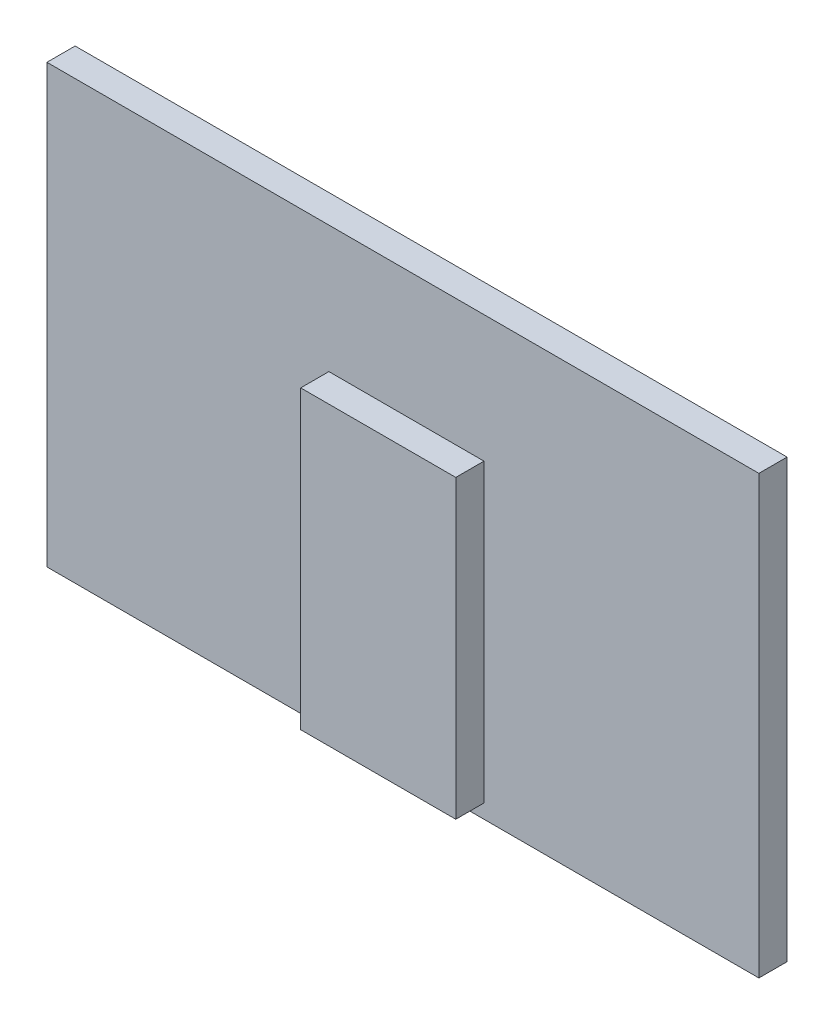
ISO-10303-21;
HEADER;
FILE_DESCRIPTION(('STEP AP214'),'2;1');
FILE_NAME('part.step','',(''),(''),'','','');
FILE_SCHEMA(('AUTOMOTIVE_DESIGN { 1 0 10303 214 1 1 1 1 }'));
ENDSEC;
DATA;
#1=APPLICATION_CONTEXT('core data for automotive mechanical design processes');
#2=APPLICATION_PROTOCOL_DEFINITION('international standard','automotive_design',2000,#1);
#3=PRODUCT_CONTEXT('',#1,'mechanical');
#4=PRODUCT('Part','Part','',(#3));
#5=PRODUCT_RELATED_PRODUCT_CATEGORY('part','',(#4));
#6=PRODUCT_DEFINITION_FORMATION('','',#4);
#7=PRODUCT_DEFINITION_CONTEXT('part definition',#1,'design');
#8=PRODUCT_DEFINITION('design','',#6,#7);
#9=PRODUCT_DEFINITION_SHAPE('','',#8);
#10=(LENGTH_UNIT() NAMED_UNIT(*) SI_UNIT(.MILLI.,.METRE.));
#11=(NAMED_UNIT(*) PLANE_ANGLE_UNIT() SI_UNIT($,.RADIAN.));
#12=(NAMED_UNIT(*) SI_UNIT($,.STERADIAN.) SOLID_ANGLE_UNIT());
#13=UNCERTAINTY_MEASURE_WITH_UNIT(LENGTH_MEASURE(1.E-05),#10,'distance_accuracy_value','');
#14=(GEOMETRIC_REPRESENTATION_CONTEXT(3) GLOBAL_UNCERTAINTY_ASSIGNED_CONTEXT((#13)) GLOBAL_UNIT_ASSIGNED_CONTEXT((#10,
#11,#12)) REPRESENTATION_CONTEXT('',''));
#15=CARTESIAN_POINT('',(0.,0.,0.));
#16=DIRECTION('',(0.,0.,1.));
#17=DIRECTION('',(1.,0.,0.));
#18=AXIS2_PLACEMENT_3D('',#15,#16,#17);
#19=CARTESIAN_POINT('',(0.,0.,20.));
#20=DIRECTION('',(0.,0.,1.));
#21=DIRECTION('',(1.,0.,0.));
#22=AXIS2_PLACEMENT_3D('',#19,#20,#21);
#23=PLANE('',#22);
#24=DIRECTION('',(0.,-1.,0.));
#25=VECTOR('',#24,1.);
#26=CARTESIAN_POINT('',(-332.927502245285,178.25,20.));
#27=LINE('',#26,#25);
#28=CARTESIAN_POINT('',(-332.927502245285,178.25,20.));
#29=VERTEX_POINT('',#28);
#30=CARTESIAN_POINT('',(-332.927502245285,-131.75,20.));
#31=VERTEX_POINT('',#30);
#32=EDGE_CURVE('E140',#29,#31,#27,.T.);
#33=ORIENTED_EDGE('',*,*,#32,.T.);
#34=DIRECTION('',(1.,0.,0.));
#35=VECTOR('',#34,1.);
#36=CARTESIAN_POINT('',(-332.927502245285,-131.75,20.));
#37=LINE('',#36,#35);
#38=CARTESIAN_POINT('',(172.072497754715,-131.75,20.));
#39=VERTEX_POINT('',#38);
#40=EDGE_CURVE('E85',#31,#39,#37,.T.);
#41=ORIENTED_EDGE('',*,*,#40,.T.);
#42=DIRECTION('',(0.,1.,0.));
#43=VECTOR('',#42,1.);
#44=CARTESIAN_POINT('',(172.072497754715,178.25,20.));
#45=LINE('',#44,#43);
#46=CARTESIAN_POINT('',(172.072497754715,178.25,20.));
#47=VERTEX_POINT('',#46);
#48=EDGE_CURVE('E143',#39,#47,#45,.T.);
#49=ORIENTED_EDGE('',*,*,#48,.T.);
#50=DIRECTION('',(-1.,0.,0.));
#51=VECTOR('',#50,1.);
#52=CARTESIAN_POINT('',(-332.927502245285,178.25,20.));
#53=LINE('',#52,#51);
#54=EDGE_CURVE('E57',#47,#29,#53,.T.);
#55=ORIENTED_EDGE('',*,*,#54,.T.);
#56=EDGE_LOOP('',(#33,#41,#49,#55));
#57=FACE_BOUND('',#56,.T.);
#58=DIRECTION('',(1.,0.,0.));
#59=VECTOR('',#58,1.);
#60=CARTESIAN_POINT('',(-132.927502245285,-121.75,20.));
#61=LINE('',#60,#59);
#62=CARTESIAN_POINT('',(-132.927502245285,-121.75,20.));
#63=VERTEX_POINT('',#62);
#64=CARTESIAN_POINT('',(-22.9275022452848,-121.75,20.));
#65=VERTEX_POINT('',#64);
#66=EDGE_CURVE('E263',#63,#65,#61,.T.);
#67=ORIENTED_EDGE('',*,*,#66,.F.);
#68=DIRECTION('',(0.,-1.,0.));
#69=VECTOR('',#68,1.);
#70=CARTESIAN_POINT('',(-132.927502245285,88.2500000000001,20.));
#71=LINE('',#70,#69);
#72=CARTESIAN_POINT('',(-132.927502245285,88.2500000000001,20.));
#73=VERTEX_POINT('',#72);
#74=EDGE_CURVE('E130',#73,#63,#71,.T.);
#75=ORIENTED_EDGE('',*,*,#74,.F.);
#76=DIRECTION('',(-1.,0.,0.));
#77=VECTOR('',#76,1.);
#78=CARTESIAN_POINT('',(-132.927502245285,88.2500000000001,20.));
#79=LINE('',#78,#77);
#80=CARTESIAN_POINT('',(-22.9275022452848,88.2500000000001,20.));
#81=VERTEX_POINT('',#80);
#82=EDGE_CURVE('E126',#81,#73,#79,.T.);
#83=ORIENTED_EDGE('',*,*,#82,.F.);
#84=DIRECTION('',(0.,1.,0.));
#85=VECTOR('',#84,1.);
#86=CARTESIAN_POINT('',(-22.9275022452848,88.2500000000001,20.));
#87=LINE('',#86,#85);
#88=EDGE_CURVE('E260',#65,#81,#87,.T.);
#89=ORIENTED_EDGE('',*,*,#88,.F.);
#90=EDGE_LOOP('',(#67,#75,#83,#89));
#91=FACE_BOUND('',#90,.T.);
#92=ADVANCED_FACE('F33',(#57,#91),#23,.T.);
#93=CARTESIAN_POINT('',(-332.927502245285,178.25,20.));
#94=DIRECTION('',(1.,0.,0.));
#95=DIRECTION('',(0.,0.,-1.));
#96=AXIS2_PLACEMENT_3D('',#93,#94,#95);
#97=PLANE('',#96);
#98=DIRECTION('',(0.,-1.,0.));
#99=VECTOR('',#98,1.);
#100=CARTESIAN_POINT('',(-332.927502245285,178.25,0.));
#101=LINE('',#100,#99);
#102=CARTESIAN_POINT('',(-332.927502245285,178.25,0.));
#103=VERTEX_POINT('',#102);
#104=CARTESIAN_POINT('',(-332.927502245285,-131.75,0.));
#105=VERTEX_POINT('',#104);
#106=EDGE_CURVE('E132',#103,#105,#101,.T.);
#107=ORIENTED_EDGE('',*,*,#106,.T.);
#108=DIRECTION('',(0.,0.,-1.));
#109=VECTOR('',#108,1.);
#110=CARTESIAN_POINT('',(-332.927502245285,-131.75,20.));
#111=LINE('',#110,#109);
#112=EDGE_CURVE('E11',#31,#105,#111,.T.);
#113=ORIENTED_EDGE('',*,*,#112,.F.);
#114=ORIENTED_EDGE('',*,*,#32,.F.);
#115=DIRECTION('',(0.,0.,-1.));
#116=VECTOR('',#115,1.);
#117=CARTESIAN_POINT('',(-332.927502245285,178.25,20.));
#118=LINE('',#117,#116);
#119=EDGE_CURVE('E145',#29,#103,#118,.T.);
#120=ORIENTED_EDGE('',*,*,#119,.T.);
#121=EDGE_LOOP('',(#107,#113,#114,#120));
#122=FACE_BOUND('',#121,.T.);
#123=ADVANCED_FACE('F35',(#122),#97,.F.);
#124=CARTESIAN_POINT('',(-332.927502245285,-131.75,20.));
#125=DIRECTION('',(0.,1.,0.));
#126=DIRECTION('',(0.,0.,1.));
#127=AXIS2_PLACEMENT_3D('',#124,#125,#126);
#128=PLANE('',#127);
#129=DIRECTION('',(1.,0.,0.));
#130=VECTOR('',#129,1.);
#131=CARTESIAN_POINT('',(-332.927502245285,-131.75,0.));
#132=LINE('',#131,#130);
#133=CARTESIAN_POINT('',(172.072497754715,-131.75,0.));
#134=VERTEX_POINT('',#133);
#135=EDGE_CURVE('E135',#105,#134,#132,.T.);
#136=ORIENTED_EDGE('',*,*,#135,.T.);
#137=DIRECTION('',(0.,0.,-1.));
#138=VECTOR('',#137,1.);
#139=CARTESIAN_POINT('',(172.072497754715,-131.75,20.));
#140=LINE('',#139,#138);
#141=EDGE_CURVE('E41',#39,#134,#140,.T.);
#142=ORIENTED_EDGE('',*,*,#141,.F.);
#143=ORIENTED_EDGE('',*,*,#40,.F.);
#144=ORIENTED_EDGE('',*,*,#112,.T.);
#145=EDGE_LOOP('',(#136,#142,#143,#144));
#146=FACE_BOUND('',#145,.T.);
#147=ADVANCED_FACE('F173',(#146),#128,.F.);
#148=CARTESIAN_POINT('',(172.072497754715,178.25,20.));
#149=DIRECTION('',(-1.,0.,0.));
#150=DIRECTION('',(0.,0.,1.));
#151=AXIS2_PLACEMENT_3D('',#148,#149,#150);
#152=PLANE('',#151);
#153=DIRECTION('',(0.,1.,0.));
#154=VECTOR('',#153,1.);
#155=CARTESIAN_POINT('',(172.072497754715,178.25,0.));
#156=LINE('',#155,#154);
#157=CARTESIAN_POINT('',(172.072497754715,178.25,0.));
#158=VERTEX_POINT('',#157);
#159=EDGE_CURVE('E148',#134,#158,#156,.T.);
#160=ORIENTED_EDGE('',*,*,#159,.T.);
#161=DIRECTION('',(0.,0.,-1.));
#162=VECTOR('',#161,1.);
#163=CARTESIAN_POINT('',(172.072497754715,178.25,20.));
#164=LINE('',#163,#162);
#165=EDGE_CURVE('E152',#47,#158,#164,.T.);
#166=ORIENTED_EDGE('',*,*,#165,.F.);
#167=ORIENTED_EDGE('',*,*,#48,.F.);
#168=ORIENTED_EDGE('',*,*,#141,.T.);
#169=EDGE_LOOP('',(#160,#166,#167,#168));
#170=FACE_BOUND('',#169,.T.);
#171=ADVANCED_FACE('F157',(#170),#152,.F.);
#172=CARTESIAN_POINT('',(-332.927502245285,178.25,20.));
#173=DIRECTION('',(0.,-1.,0.));
#174=DIRECTION('',(0.,0.,-1.));
#175=AXIS2_PLACEMENT_3D('',#172,#173,#174);
#176=PLANE('',#175);
#177=DIRECTION('',(-1.,0.,0.));
#178=VECTOR('',#177,1.);
#179=CARTESIAN_POINT('',(-332.927502245285,178.25,0.));
#180=LINE('',#179,#178);
#181=EDGE_CURVE('E78',#158,#103,#180,.T.);
#182=ORIENTED_EDGE('',*,*,#181,.T.);
#183=ORIENTED_EDGE('',*,*,#119,.F.);
#184=ORIENTED_EDGE('',*,*,#54,.F.);
#185=ORIENTED_EDGE('',*,*,#165,.T.);
#186=EDGE_LOOP('',(#182,#183,#184,#185));
#187=FACE_BOUND('',#186,.T.);
#188=ADVANCED_FACE('F165',(#187),#176,.F.);
#189=CARTESIAN_POINT('',(0.,0.,0.));
#190=DIRECTION('',(0.,0.,1.));
#191=DIRECTION('',(1.,0.,0.));
#192=AXIS2_PLACEMENT_3D('',#189,#190,#191);
#193=PLANE('',#192);
#194=ORIENTED_EDGE('',*,*,#106,.F.);
#195=ORIENTED_EDGE('',*,*,#181,.F.);
#196=ORIENTED_EDGE('',*,*,#159,.F.);
#197=ORIENTED_EDGE('',*,*,#135,.F.);
#198=EDGE_LOOP('',(#194,#195,#196,#197));
#199=FACE_BOUND('',#198,.T.);
#200=ADVANCED_FACE('F161',(#199),#193,.F.);
#201=CARTESIAN_POINT('',(-132.927502245285,88.2500000000001,40.));
#202=DIRECTION('',(1.,0.,0.));
#203=DIRECTION('',(0.,1.,0.));
#204=AXIS2_PLACEMENT_3D('',#201,#202,#203);
#205=PLANE('',#204);
#206=ORIENTED_EDGE('',*,*,#74,.T.);
#207=DIRECTION('',(0.,0.,-1.));
#208=VECTOR('',#207,1.);
#209=CARTESIAN_POINT('',(-132.927502245285,-121.75,40.));
#210=LINE('',#209,#208);
#211=CARTESIAN_POINT('',(-132.927502245285,-121.75,40.));
#212=VERTEX_POINT('',#211);
#213=EDGE_CURVE('E111',#212,#63,#210,.T.);
#214=ORIENTED_EDGE('',*,*,#213,.F.);
#215=DIRECTION('',(0.,-1.,0.));
#216=VECTOR('',#215,1.);
#217=CARTESIAN_POINT('',(-132.927502245285,88.2500000000001,40.));
#218=LINE('',#217,#216);
#219=CARTESIAN_POINT('',(-132.927502245285,88.2500000000001,40.));
#220=VERTEX_POINT('',#219);
#221=EDGE_CURVE('E118',#220,#212,#218,.T.);
#222=ORIENTED_EDGE('',*,*,#221,.F.);
#223=DIRECTION('',(0.,0.,-1.));
#224=VECTOR('',#223,1.);
#225=CARTESIAN_POINT('',(-132.927502245285,88.2500000000001,40.));
#226=LINE('',#225,#224);
#227=EDGE_CURVE('E258',#220,#73,#226,.T.);
#228=ORIENTED_EDGE('',*,*,#227,.T.);
#229=EDGE_LOOP('',(#206,#214,#222,#228));
#230=FACE_BOUND('',#229,.T.);
#231=ADVANCED_FACE('F128',(#230),#205,.F.);
#232=CARTESIAN_POINT('',(-132.927502245285,-121.75,40.));
#233=DIRECTION('',(0.,1.,0.));
#234=DIRECTION('',(-1.,0.,0.));
#235=AXIS2_PLACEMENT_3D('',#232,#233,#234);
#236=PLANE('',#235);
#237=ORIENTED_EDGE('',*,*,#66,.T.);
#238=DIRECTION('',(0.,0.,-1.));
#239=VECTOR('',#238,1.);
#240=CARTESIAN_POINT('',(-22.9275022452848,-121.75,40.));
#241=LINE('',#240,#239);
#242=CARTESIAN_POINT('',(-22.9275022452848,-121.75,40.));
#243=VERTEX_POINT('',#242);
#244=EDGE_CURVE('E114',#243,#65,#241,.T.);
#245=ORIENTED_EDGE('',*,*,#244,.F.);
#246=DIRECTION('',(1.,0.,0.));
#247=VECTOR('',#246,1.);
#248=CARTESIAN_POINT('',(-132.927502245285,-121.75,40.));
#249=LINE('',#248,#247);
#250=EDGE_CURVE('E107',#212,#243,#249,.T.);
#251=ORIENTED_EDGE('',*,*,#250,.F.);
#252=ORIENTED_EDGE('',*,*,#213,.T.);
#253=EDGE_LOOP('',(#237,#245,#251,#252));
#254=FACE_BOUND('',#253,.T.);
#255=ADVANCED_FACE('F109',(#254),#236,.F.);
#256=CARTESIAN_POINT('',(-22.9275022452848,88.2500000000001,40.));
#257=DIRECTION('',(-1.,0.,0.));
#258=DIRECTION('',(0.,-1.,0.));
#259=AXIS2_PLACEMENT_3D('',#256,#257,#258);
#260=PLANE('',#259);
#261=ORIENTED_EDGE('',*,*,#88,.T.);
#262=DIRECTION('',(0.,0.,-1.));
#263=VECTOR('',#262,1.);
#264=CARTESIAN_POINT('',(-22.9275022452848,88.2500000000001,40.));
#265=LINE('',#264,#263);
#266=CARTESIAN_POINT('',(-22.9275022452848,88.2500000000001,40.));
#267=VERTEX_POINT('',#266);
#268=EDGE_CURVE('E48',#267,#81,#265,.T.);
#269=ORIENTED_EDGE('',*,*,#268,.F.);
#270=DIRECTION('',(0.,1.,0.));
#271=VECTOR('',#270,1.);
#272=CARTESIAN_POINT('',(-22.9275022452848,88.2500000000001,40.));
#273=LINE('',#272,#271);
#274=EDGE_CURVE('E117',#243,#267,#273,.T.);
#275=ORIENTED_EDGE('',*,*,#274,.F.);
#276=ORIENTED_EDGE('',*,*,#244,.T.);
#277=EDGE_LOOP('',(#261,#269,#275,#276));
#278=FACE_BOUND('',#277,.T.);
#279=ADVANCED_FACE('F186',(#278),#260,.F.);
#280=CARTESIAN_POINT('',(-132.927502245285,88.2500000000001,40.));
#281=DIRECTION('',(0.,-1.,0.));
#282=DIRECTION('',(1.,0.,0.));
#283=AXIS2_PLACEMENT_3D('',#280,#281,#282);
#284=PLANE('',#283);
#285=ORIENTED_EDGE('',*,*,#82,.T.);
#286=ORIENTED_EDGE('',*,*,#227,.F.);
#287=DIRECTION('',(-1.,0.,0.));
#288=VECTOR('',#287,1.);
#289=CARTESIAN_POINT('',(-132.927502245285,88.2500000000001,40.));
#290=LINE('',#289,#288);
#291=EDGE_CURVE('E122',#267,#220,#290,.T.);
#292=ORIENTED_EDGE('',*,*,#291,.F.);
#293=ORIENTED_EDGE('',*,*,#268,.T.);
#294=EDGE_LOOP('',(#285,#286,#292,#293));
#295=FACE_BOUND('',#294,.T.);
#296=ADVANCED_FACE('F189',(#295),#284,.F.);
#297=CARTESIAN_POINT('',(0.,0.,40.));
#298=DIRECTION('',(0.,0.,1.));
#299=DIRECTION('',(1.,0.,0.));
#300=AXIS2_PLACEMENT_3D('',#297,#298,#299);
#301=PLANE('',#300);
#302=ORIENTED_EDGE('',*,*,#221,.T.);
#303=ORIENTED_EDGE('',*,*,#250,.T.);
#304=ORIENTED_EDGE('',*,*,#274,.T.);
#305=ORIENTED_EDGE('',*,*,#291,.T.);
#306=EDGE_LOOP('',(#302,#303,#304,#305));
#307=FACE_BOUND('',#306,.T.);
#308=ADVANCED_FACE('F121',(#307),#301,.T.);
#309=CLOSED_SHELL('',(#92,#123,#147,#171,#188,#200,#231,#255,#279,#296,#308));
#310=MANIFOLD_SOLID_BREP('B2',#309);
#311=ADVANCED_BREP_SHAPE_REPRESENTATION('',(#18,#310),#14);
#312=SHAPE_DEFINITION_REPRESENTATION(#9,#311);
ENDSEC;
END-ISO-10303-21;
